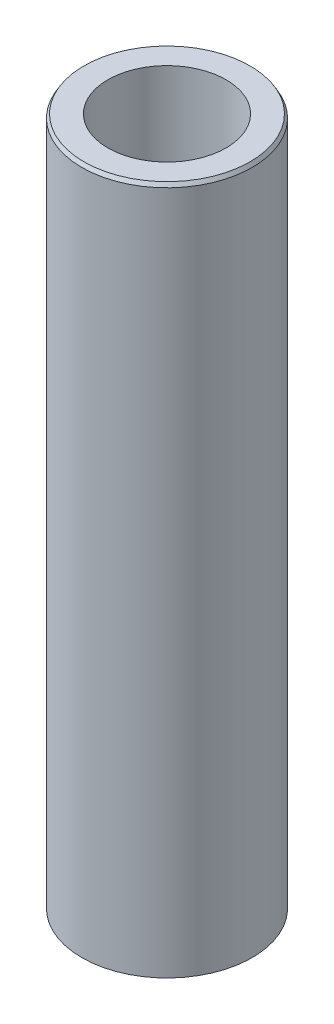
ISO-10303-21;
HEADER;
FILE_DESCRIPTION(('STEP AP214'),'2;1');
FILE_NAME('part.step','',(''),(''),'','','');
FILE_SCHEMA(('AUTOMOTIVE_DESIGN { 1 0 10303 214 1 1 1 1 }'));
ENDSEC;
DATA;
#1=APPLICATION_CONTEXT('core data for automotive mechanical design processes');
#2=APPLICATION_PROTOCOL_DEFINITION('international standard','automotive_design',2000,#1);
#3=PRODUCT_CONTEXT('',#1,'mechanical');
#4=PRODUCT('Part','Part','',(#3));
#5=PRODUCT_RELATED_PRODUCT_CATEGORY('part','',(#4));
#6=PRODUCT_DEFINITION_FORMATION('','',#4);
#7=PRODUCT_DEFINITION_CONTEXT('part definition',#1,'design');
#8=PRODUCT_DEFINITION('design','',#6,#7);
#9=PRODUCT_DEFINITION_SHAPE('','',#8);
#10=(LENGTH_UNIT() NAMED_UNIT(*) SI_UNIT(.MILLI.,.METRE.));
#11=(NAMED_UNIT(*) PLANE_ANGLE_UNIT() SI_UNIT($,.RADIAN.));
#12=(NAMED_UNIT(*) SI_UNIT($,.STERADIAN.) SOLID_ANGLE_UNIT());
#13=UNCERTAINTY_MEASURE_WITH_UNIT(LENGTH_MEASURE(1.E-05),#10,'distance_accuracy_value','');
#14=(GEOMETRIC_REPRESENTATION_CONTEXT(3) GLOBAL_UNCERTAINTY_ASSIGNED_CONTEXT((#13)) GLOBAL_UNIT_ASSIGNED_CONTEXT((#10,
#11,#12)) REPRESENTATION_CONTEXT('',''));
#15=CARTESIAN_POINT('',(0.,0.,0.));
#16=DIRECTION('',(0.,0.,1.));
#17=DIRECTION('',(1.,0.,0.));
#18=AXIS2_PLACEMENT_3D('',#15,#16,#17);
#19=CARTESIAN_POINT('',(0.,424.988365480542,0.));
#20=DIRECTION('',(0.,-1.,0.));
#21=DIRECTION('',(0.,0.,-1.));
#22=AXIS2_PLACEMENT_3D('',#19,#20,#21);
#23=CYLINDRICAL_SURFACE('',#22,52.5);
#24=CARTESIAN_POINT('',(0.,422.663512163995,0.));
#25=DIRECTION('',(0.,1.,0.));
#26=DIRECTION('',(0.,0.,1.));
#27=AXIS2_PLACEMENT_3D('',#24,#25,#26);
#28=CIRCLE('',#27,52.5);
#29=CARTESIAN_POINT('',(0.,422.663512163995,52.5));
#30=VERTEX_POINT('',#29);
#31=EDGE_CURVE('E50',#30,#30,#28,.F.);
#32=ORIENTED_EDGE('',*,*,#31,.T.);
#33=EDGE_LOOP('',(#32));
#34=FACE_BOUND('',#33,.T.);
#35=CARTESIAN_POINT('',(0.,1.34225468813476,0.));
#36=DIRECTION('',(0.,1.,0.));
#37=DIRECTION('',(0.,0.,1.));
#38=AXIS2_PLACEMENT_3D('',#35,#36,#37);
#39=CIRCLE('',#38,52.5);
#40=CARTESIAN_POINT('',(0.,1.34225468813476,52.5));
#41=VERTEX_POINT('',#40);
#42=EDGE_CURVE('E51',#41,#41,#39,.T.);
#43=ORIENTED_EDGE('',*,*,#42,.T.);
#44=EDGE_LOOP('',(#43));
#45=FACE_BOUND('',#44,.T.);
#46=ADVANCED_FACE('F39',(#34,#45),#23,.T.);
#47=CARTESIAN_POINT('',(0.,424.988365480542,0.));
#48=DIRECTION('',(0.,1.,0.));
#49=DIRECTION('',(0.,0.,1.));
#50=AXIS2_PLACEMENT_3D('',#47,#48,#49);
#51=PLANE('',#50);
#52=CARTESIAN_POINT('',(0.,424.988365480542,0.));
#53=DIRECTION('',(0.,1.,0.));
#54=DIRECTION('',(0.,0.,1.));
#55=AXIS2_PLACEMENT_3D('',#52,#53,#54);
#56=CIRCLE('',#55,51.1577453118653);
#57=CARTESIAN_POINT('',(0.,424.988365480542,51.1577453118653));
#58=VERTEX_POINT('',#57);
#59=EDGE_CURVE('E54',#58,#58,#56,.T.);
#60=ORIENTED_EDGE('',*,*,#59,.T.);
#61=EDGE_LOOP('',(#60));
#62=FACE_BOUND('',#61,.T.);
#63=CARTESIAN_POINT('',(0.,424.988365480542,0.));
#64=DIRECTION('',(0.,1.,0.));
#65=DIRECTION('',(0.,0.,1.));
#66=AXIS2_PLACEMENT_3D('',#63,#64,#65);
#67=CIRCLE('',#66,36.3998148537138);
#68=CARTESIAN_POINT('',(0.,424.988365480542,36.3998148537138));
#69=VERTEX_POINT('',#68);
#70=EDGE_CURVE('E58',#69,#69,#67,.T.);
#71=ORIENTED_EDGE('',*,*,#70,.F.);
#72=EDGE_LOOP('',(#71));
#73=FACE_BOUND('',#72,.T.);
#74=ADVANCED_FACE('F69',(#62,#73),#51,.T.);
#75=CARTESIAN_POINT('',(0.,0.,0.));
#76=DIRECTION('',(0.,1.,0.));
#77=DIRECTION('',(0.,0.,1.));
#78=AXIS2_PLACEMENT_3D('',#75,#76,#77);
#79=PLANE('',#78);
#80=CARTESIAN_POINT('',(0.,0.,0.));
#81=DIRECTION('',(0.,1.,0.));
#82=DIRECTION('',(0.,0.,1.));
#83=AXIS2_PLACEMENT_3D('',#80,#81,#82);
#84=CIRCLE('',#83,50.1751466834531);
#85=CARTESIAN_POINT('',(0.,0.,50.1751466834531));
#86=VERTEX_POINT('',#85);
#87=EDGE_CURVE('E10',#86,#86,#84,.F.);
#88=ORIENTED_EDGE('',*,*,#87,.T.);
#89=EDGE_LOOP('',(#88));
#90=FACE_BOUND('',#89,.T.);
#91=CARTESIAN_POINT('',(0.,0.,0.));
#92=DIRECTION('',(0.,1.,0.));
#93=DIRECTION('',(0.,0.,1.));
#94=AXIS2_PLACEMENT_3D('',#91,#92,#93);
#95=CIRCLE('',#94,36.3998148537138);
#96=CARTESIAN_POINT('',(0.,0.,36.3998148537138));
#97=VERTEX_POINT('',#96);
#98=EDGE_CURVE('E63',#97,#97,#95,.T.);
#99=ORIENTED_EDGE('',*,*,#98,.T.);
#100=EDGE_LOOP('',(#99));
#101=FACE_BOUND('',#100,.T.);
#102=ADVANCED_FACE('F75',(#90,#101),#79,.F.);
#103=CARTESIAN_POINT('',(0.,424.988365480542,0.));
#104=DIRECTION('',(0.,-1.,0.));
#105=DIRECTION('',(0.,0.,-1.));
#106=AXIS2_PLACEMENT_3D('',#103,#104,#105);
#107=CYLINDRICAL_SURFACE('',#106,36.3998148537138);
#108=ORIENTED_EDGE('',*,*,#70,.T.);
#109=EDGE_LOOP('',(#108));
#110=FACE_BOUND('',#109,.T.);
#111=ORIENTED_EDGE('',*,*,#98,.F.);
#112=EDGE_LOOP('',(#111));
#113=FACE_BOUND('',#112,.T.);
#114=ADVANCED_FACE('F70',(#110,#113),#107,.F.);
#115=CARTESIAN_POINT('',(0.,424.988365480542,0.));
#116=DIRECTION('',(0.,-1.,0.));
#117=DIRECTION('',(0.,0.,-1.));
#118=AXIS2_PLACEMENT_3D('',#115,#116,#117);
#119=CONICAL_SURFACE('',#118,51.1577453118653,0.523598775598314);
#120=ORIENTED_EDGE('',*,*,#31,.F.);
#121=EDGE_LOOP('',(#120));
#122=FACE_BOUND('',#121,.T.);
#123=ORIENTED_EDGE('',*,*,#59,.F.);
#124=EDGE_LOOP('',(#123));
#125=FACE_BOUND('',#124,.T.);
#126=ADVANCED_FACE('F81',(#122,#125),#119,.T.);
#127=CARTESIAN_POINT('',(0.,1.34225468813476,0.));
#128=DIRECTION('',(0.,1.,0.));
#129=DIRECTION('',(0.,0.,1.));
#130=AXIS2_PLACEMENT_3D('',#127,#128,#129);
#131=CONICAL_SURFACE('',#130,52.5,1.0471975511966);
#132=CARTESIAN_POINT('',(0.,0.,50.1751466834531));
#133=CARTESIAN_POINT('',(0.,0.0139818196680687,50.1993639055004));
#134=CARTESIAN_POINT('',(0.,0.0279636393361396,50.2235811275478));
#135=CARTESIAN_POINT('',(0.,0.0559272786722814,50.2720155716425));
#136=CARTESIAN_POINT('',(0.,0.0699090983403522,50.2962327936899));
#137=CARTESIAN_POINT('',(0.,0.0978727376764931,50.3446672377846));
#138=CARTESIAN_POINT('',(0.,0.111854557344563,50.368884459832));
#139=CARTESIAN_POINT('',(0.,0.139818196680704,50.4173189039267));
#140=CARTESIAN_POINT('',(0.,0.153800016348774,50.4415361259741));
#141=CARTESIAN_POINT('',(0.,0.181763655684915,50.4899705700688));
#142=CARTESIAN_POINT('',(0.,0.195745475352986,50.5141877921162));
#143=CARTESIAN_POINT('',(0.,0.223709114689126,50.5626222362109));
#144=CARTESIAN_POINT('',(0.,0.237690934357196,50.5868394582583));
#145=CARTESIAN_POINT('',(0.,0.265654573693337,50.635273902353));
#146=CARTESIAN_POINT('',(0.,0.279636393361408,50.6594911244004));
#147=CARTESIAN_POINT('',(0.,0.307600032697549,50.7079255684951));
#148=CARTESIAN_POINT('',(0.,0.321581852365619,50.7321427905424));
#149=CARTESIAN_POINT('',(0.,0.34954549170176,50.7805772346372));
#150=CARTESIAN_POINT('',(0.,0.36352731136983,50.8047944566845));
#151=CARTESIAN_POINT('',(0.,0.391490950705971,50.8532289007793));
#152=CARTESIAN_POINT('',(0.,0.405472770374042,50.8774461228266));
#153=CARTESIAN_POINT('',(0.,0.433436409710182,50.9258805669214));
#154=CARTESIAN_POINT('',(0.,0.447418229378252,50.9500977889687));
#155=CARTESIAN_POINT('',(0.,0.475381868714393,50.9985322330634));
#156=CARTESIAN_POINT('',(0.,0.489363688382464,51.0227494551108));
#157=CARTESIAN_POINT('',(0.,0.517327327718605,51.0711838992055));
#158=CARTESIAN_POINT('',(0.,0.531309147386675,51.0954011212529));
#159=CARTESIAN_POINT('',(0.,0.559272786722816,51.1438355653476));
#160=CARTESIAN_POINT('',(0.,0.573254606390887,51.168052787395));
#161=CARTESIAN_POINT('',(0.,0.601218245727027,51.2164872314897));
#162=CARTESIAN_POINT('',(0.,0.615200065395097,51.2407044535371));
#163=CARTESIAN_POINT('',(0.,0.643163704731238,51.2891388976318));
#164=CARTESIAN_POINT('',(0.,0.657145524399309,51.3133561196792));
#165=CARTESIAN_POINT('',(0.,0.68510916373545,51.3617905637739));
#166=CARTESIAN_POINT('',(0.,0.69909098340352,51.3860077858213));
#167=CARTESIAN_POINT('',(0.,0.727054622739661,51.434442229916));
#168=CARTESIAN_POINT('',(0.,0.741036442407731,51.4586594519633));
#169=CARTESIAN_POINT('',(0.,0.769000081743872,51.5070938960581));
#170=CARTESIAN_POINT('',(0.,0.782981901411943,51.5313111181054));
#171=CARTESIAN_POINT('',(0.,0.810945540748083,51.5797455622002));
#172=CARTESIAN_POINT('',(0.,0.824927360416153,51.6039627842475));
#173=CARTESIAN_POINT('',(0.,0.852890999752294,51.6523972283423));
#174=CARTESIAN_POINT('',(0.,0.866872819420365,51.6766144503896));
#175=CARTESIAN_POINT('',(0.,0.894836458756506,51.7250488944844));
#176=CARTESIAN_POINT('',(0.,0.908818278424576,51.7492661165317));
#177=CARTESIAN_POINT('',(0.,0.936781917760717,51.7977005606265));
#178=CARTESIAN_POINT('',(0.,0.950763737428787,51.8219177826738));
#179=CARTESIAN_POINT('',(0.,0.978727376764928,51.8703522267685));
#180=CARTESIAN_POINT('',(0.,0.992709196432999,51.8945694488159));
#181=CARTESIAN_POINT('',(0.,1.02067283576914,51.9430038929106));
#182=CARTESIAN_POINT('',(0.,1.03465465543721,51.967221114958));
#183=CARTESIAN_POINT('',(0.,1.06261829477335,52.0156555590527));
#184=CARTESIAN_POINT('',(0.,1.07660011444142,52.0398727811001));
#185=CARTESIAN_POINT('',(0.,1.10456375377756,52.0883072251948));
#186=CARTESIAN_POINT('',(0.,1.11854557344563,52.1125244472422));
#187=CARTESIAN_POINT('',(0.,1.14650921278177,52.1609588913369));
#188=CARTESIAN_POINT('',(0.,1.16049103244984,52.1851761133843));
#189=CARTESIAN_POINT('',(0.,1.18845467178598,52.233610557479));
#190=CARTESIAN_POINT('',(0.,1.20243649145405,52.2578277795264));
#191=CARTESIAN_POINT('',(0.,1.2304001307902,52.3062622236211));
#192=CARTESIAN_POINT('',(0.,1.24438195045827,52.3304794456685));
#193=CARTESIAN_POINT('',(0.,1.27234558979441,52.3789138897632));
#194=CARTESIAN_POINT('',(0.,1.28632740946248,52.4031311118105));
#195=CARTESIAN_POINT('',(0.,1.31429104879862,52.4515655559053));
#196=CARTESIAN_POINT('',(0.,1.32827286846669,52.4757827779526));
#197=CARTESIAN_POINT('',(0.,1.34225468813476,52.5));
#198=B_SPLINE_CURVE_WITH_KNOTS('',3,(#132,#133,#134,#135,#136,#137,#138,#139,#140,#141,#142,
#143,#144,#145,#146,#147,#148,#149,#150,#151,#152,#153,#154,#155,#156,#157,#158,#159,#160,#161,
#162,#163,#164,#165,#166,#167,#168,#169,#170,#171,#172,#173,#174,#175,#176,#177,#178,#179,#180,
#181,#182,#183,#184,#185,#186,#187,#188,#189,#190,#191,#192,#193,#194,#195,#196,#197),
.UNSPECIFIED.,.F.,.F.,(4,2,2,2,2,2,2,2,2,2,2,2,2,2,2,2,2,2,2,2,2,2,2,2,2,2,2,2,2,2,2,2,4),(0.,
0.0838909180084238,0.167781836016842,0.251672754025265,0.335563672033689,0.419454590042113,
0.503345508050537,0.587236426058954,0.671127344067378,0.755018262075802,0.838909180084226,
0.92280009809265,1.00669101610107,1.09058193410949,1.17447285211791,1.25836377012634,
1.34225468813476,1.42614560614318,1.5100365241516,1.59392744216003,1.67781836016845,
1.76170927817687,1.84560019618529,1.92949111419372,2.01338203220214,2.09727295021056,
2.18116386821898,2.26505478622741,2.34894570423583,2.43283662224425,2.51672754025267,
2.60061845826109,2.68450937626952),.UNSPECIFIED.);
#199=EDGE_CURVE('BSEAM45',#86,#41,#198,.T.);
#200=ORIENTED_EDGE('',*,*,#87,.F.);
#201=ORIENTED_EDGE('',*,*,#42,.F.);
#202=ORIENTED_EDGE('',*,*,#199,.T.);
#203=ORIENTED_EDGE('',*,*,#199,.F.);
#204=EDGE_LOOP('',(#200,#202,#201,#203));
#205=FACE_BOUND('',#204,.T.);
#206=ADVANCED_FACE('F45',(#205),#131,.T.);
#207=CLOSED_SHELL('',(#46,#74,#102,#114,#126,#206));
#208=MANIFOLD_SOLID_BREP('B2',#207);
#209=ADVANCED_BREP_SHAPE_REPRESENTATION('',(#18,#208),#14);
#210=SHAPE_DEFINITION_REPRESENTATION(#9,#209);
ENDSEC;
END-ISO-10303-21;
